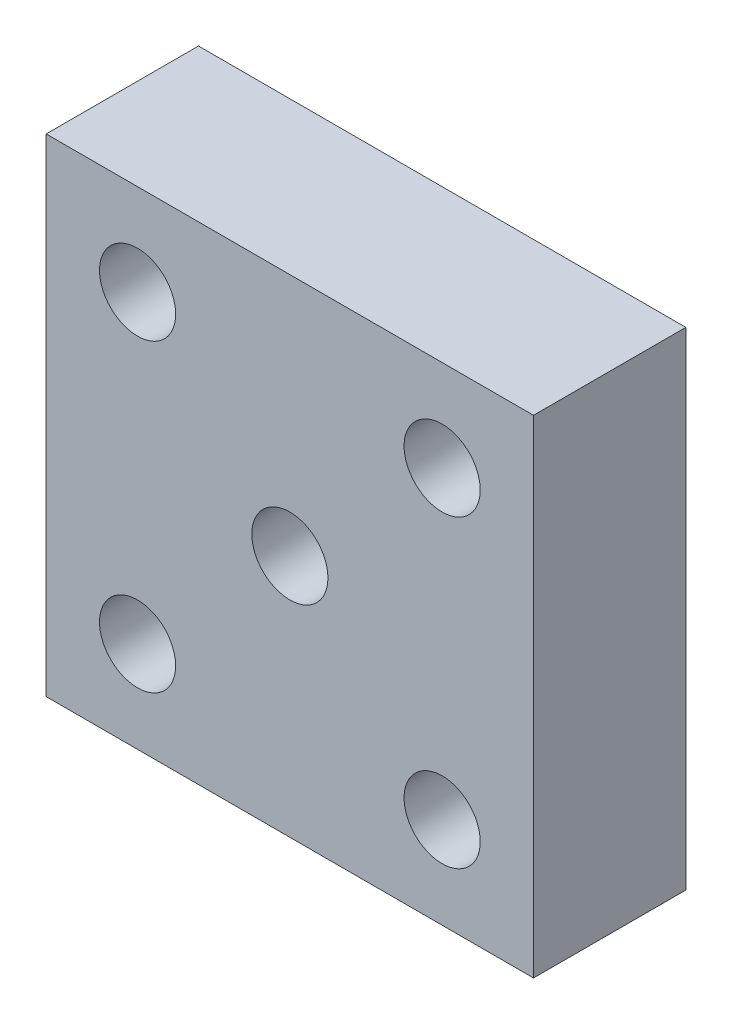
ISO-10303-21;
HEADER;
FILE_DESCRIPTION(('STEP AP214'),'2;1');
FILE_NAME('part.step','',(''),(''),'','','');
FILE_SCHEMA(('AUTOMOTIVE_DESIGN { 1 0 10303 214 1 1 1 1 }'));
ENDSEC;
DATA;
#1=APPLICATION_CONTEXT('core data for automotive mechanical design processes');
#2=APPLICATION_PROTOCOL_DEFINITION('international standard','automotive_design',2000,#1);
#3=PRODUCT_CONTEXT('',#1,'mechanical');
#4=PRODUCT('Part','Part','',(#3));
#5=PRODUCT_RELATED_PRODUCT_CATEGORY('part','',(#4));
#6=PRODUCT_DEFINITION_FORMATION('','',#4);
#7=PRODUCT_DEFINITION_CONTEXT('part definition',#1,'design');
#8=PRODUCT_DEFINITION('design','',#6,#7);
#9=PRODUCT_DEFINITION_SHAPE('','',#8);
#10=(LENGTH_UNIT() NAMED_UNIT(*) SI_UNIT(.MILLI.,.METRE.));
#11=(NAMED_UNIT(*) PLANE_ANGLE_UNIT() SI_UNIT($,.RADIAN.));
#12=(NAMED_UNIT(*) SI_UNIT($,.STERADIAN.) SOLID_ANGLE_UNIT());
#13=UNCERTAINTY_MEASURE_WITH_UNIT(LENGTH_MEASURE(1.E-05),#10,'distance_accuracy_value','');
#14=(GEOMETRIC_REPRESENTATION_CONTEXT(3) GLOBAL_UNCERTAINTY_ASSIGNED_CONTEXT((#13)) GLOBAL_UNIT_ASSIGNED_CONTEXT((#10,
#11,#12)) REPRESENTATION_CONTEXT('',''));
#15=CARTESIAN_POINT('',(0.,0.,0.));
#16=DIRECTION('',(0.,0.,1.));
#17=DIRECTION('',(1.,0.,0.));
#18=AXIS2_PLACEMENT_3D('',#15,#16,#17);
#19=CARTESIAN_POINT('',(0.,0.,5.));
#20=DIRECTION('',(0.,0.,1.));
#21=DIRECTION('',(1.,0.,0.));
#22=AXIS2_PLACEMENT_3D('',#19,#20,#21);
#23=PLANE('',#22);
#24=CARTESIAN_POINT('',(-5.,-5.,5.));
#25=DIRECTION('',(0.,0.,1.));
#26=DIRECTION('',(1.,0.,0.));
#27=AXIS2_PLACEMENT_3D('',#24,#25,#26);
#28=CIRCLE('',#27,1.25);
#29=CARTESIAN_POINT('',(-3.75,-5.,5.));
#30=VERTEX_POINT('',#29);
#31=EDGE_CURVE('E127',#30,#30,#28,.T.);
#32=ORIENTED_EDGE('',*,*,#31,.F.);
#33=EDGE_LOOP('',(#32));
#34=FACE_BOUND('',#33,.T.);
#35=CARTESIAN_POINT('',(5.,5.,5.));
#36=DIRECTION('',(0.,0.,1.));
#37=DIRECTION('',(1.,0.,0.));
#38=AXIS2_PLACEMENT_3D('',#35,#36,#37);
#39=CIRCLE('',#38,1.25);
#40=CARTESIAN_POINT('',(6.25,5.,5.));
#41=VERTEX_POINT('',#40);
#42=EDGE_CURVE('E115',#41,#41,#39,.T.);
#43=ORIENTED_EDGE('',*,*,#42,.F.);
#44=EDGE_LOOP('',(#43));
#45=FACE_BOUND('',#44,.T.);
#46=DIRECTION('',(0.,-1.,0.));
#47=VECTOR('',#46,1.);
#48=CARTESIAN_POINT('',(-7.99999999999999,8.,5.));
#49=LINE('',#48,#47);
#50=CARTESIAN_POINT('',(-7.99999999999999,8.,5.));
#51=VERTEX_POINT('',#50);
#52=CARTESIAN_POINT('',(-7.99999999999999,-8.,5.));
#53=VERTEX_POINT('',#52);
#54=EDGE_CURVE('E85',#51,#53,#49,.T.);
#55=ORIENTED_EDGE('',*,*,#54,.T.);
#56=DIRECTION('',(1.,0.,0.));
#57=VECTOR('',#56,1.);
#58=CARTESIAN_POINT('',(-7.99999999999999,-8.,5.));
#59=LINE('',#58,#57);
#60=CARTESIAN_POINT('',(7.99999999999999,-8.,5.));
#61=VERTEX_POINT('',#60);
#62=EDGE_CURVE('E80',#53,#61,#59,.T.);
#63=ORIENTED_EDGE('',*,*,#62,.T.);
#64=DIRECTION('',(0.,1.,0.));
#65=VECTOR('',#64,1.);
#66=CARTESIAN_POINT('',(7.99999999999999,8.,5.));
#67=LINE('',#66,#65);
#68=CARTESIAN_POINT('',(7.99999999999999,8.,5.));
#69=VERTEX_POINT('',#68);
#70=EDGE_CURVE('E83',#61,#69,#67,.T.);
#71=ORIENTED_EDGE('',*,*,#70,.T.);
#72=DIRECTION('',(-1.,0.,0.));
#73=VECTOR('',#72,1.);
#74=CARTESIAN_POINT('',(-7.99999999999999,8.,5.));
#75=LINE('',#74,#73);
#76=EDGE_CURVE('E50',#69,#51,#75,.T.);
#77=ORIENTED_EDGE('',*,*,#76,.T.);
#78=EDGE_LOOP('',(#55,#63,#71,#77));
#79=FACE_BOUND('',#78,.T.);
#80=CARTESIAN_POINT('',(-5.,5.,5.));
#81=DIRECTION('',(0.,0.,1.));
#82=DIRECTION('',(1.,0.,0.));
#83=AXIS2_PLACEMENT_3D('',#80,#81,#82);
#84=CIRCLE('',#83,1.25);
#85=CARTESIAN_POINT('',(-3.75,5.,5.));
#86=VERTEX_POINT('',#85);
#87=EDGE_CURVE('E100',#86,#86,#84,.T.);
#88=ORIENTED_EDGE('',*,*,#87,.F.);
#89=EDGE_LOOP('',(#88));
#90=FACE_BOUND('',#89,.T.);
#91=CARTESIAN_POINT('',(5.,-5.,5.));
#92=DIRECTION('',(0.,0.,1.));
#93=DIRECTION('',(1.,0.,0.));
#94=AXIS2_PLACEMENT_3D('',#91,#92,#93);
#95=CIRCLE('',#94,1.25);
#96=CARTESIAN_POINT('',(6.25,-5.,5.));
#97=VERTEX_POINT('',#96);
#98=EDGE_CURVE('E121',#97,#97,#95,.T.);
#99=ORIENTED_EDGE('',*,*,#98,.F.);
#100=EDGE_LOOP('',(#99));
#101=FACE_BOUND('',#100,.T.);
#102=CARTESIAN_POINT('',(0.,0.,5.));
#103=DIRECTION('',(0.,0.,1.));
#104=DIRECTION('',(1.,0.,0.));
#105=AXIS2_PLACEMENT_3D('',#102,#103,#104);
#106=CIRCLE('',#105,1.25);
#107=CARTESIAN_POINT('',(1.25,0.,5.));
#108=VERTEX_POINT('',#107);
#109=EDGE_CURVE('E133',#108,#108,#106,.T.);
#110=ORIENTED_EDGE('',*,*,#109,.F.);
#111=EDGE_LOOP('',(#110));
#112=FACE_BOUND('',#111,.T.);
#113=ADVANCED_FACE('F33',(#34,#45,#79,#90,#101,#112),#23,.T.);
#114=CARTESIAN_POINT('',(0.,0.,0.));
#115=DIRECTION('',(0.,0.,1.));
#116=DIRECTION('',(1.,0.,0.));
#117=AXIS2_PLACEMENT_3D('',#114,#115,#116);
#118=PLANE('',#117);
#119=DIRECTION('',(0.,-1.,0.));
#120=VECTOR('',#119,1.);
#121=CARTESIAN_POINT('',(-7.99999999999999,8.,0.));
#122=LINE('',#121,#120);
#123=CARTESIAN_POINT('',(-7.99999999999999,8.,0.));
#124=VERTEX_POINT('',#123);
#125=CARTESIAN_POINT('',(-7.99999999999999,-8.,0.));
#126=VERTEX_POINT('',#125);
#127=EDGE_CURVE('E97',#124,#126,#122,.T.);
#128=ORIENTED_EDGE('',*,*,#127,.F.);
#129=DIRECTION('',(-1.,0.,0.));
#130=VECTOR('',#129,1.);
#131=CARTESIAN_POINT('',(-7.99999999999999,8.,0.));
#132=LINE('',#131,#130);
#133=CARTESIAN_POINT('',(7.99999999999999,8.,0.));
#134=VERTEX_POINT('',#133);
#135=EDGE_CURVE('E73',#134,#124,#132,.T.);
#136=ORIENTED_EDGE('',*,*,#135,.F.);
#137=DIRECTION('',(0.,1.,0.));
#138=VECTOR('',#137,1.);
#139=CARTESIAN_POINT('',(7.99999999999999,8.,0.));
#140=LINE('',#139,#138);
#141=CARTESIAN_POINT('',(7.99999999999999,-8.,0.));
#142=VERTEX_POINT('',#141);
#143=EDGE_CURVE('E67',#142,#134,#140,.T.);
#144=ORIENTED_EDGE('',*,*,#143,.F.);
#145=DIRECTION('',(1.,0.,0.));
#146=VECTOR('',#145,1.);
#147=CARTESIAN_POINT('',(-7.99999999999999,-8.,0.));
#148=LINE('',#147,#146);
#149=EDGE_CURVE('E89',#126,#142,#148,.T.);
#150=ORIENTED_EDGE('',*,*,#149,.F.);
#151=EDGE_LOOP('',(#128,#136,#144,#150));
#152=FACE_BOUND('',#151,.T.);
#153=CARTESIAN_POINT('',(-5.,5.,0.));
#154=DIRECTION('',(0.,0.,1.));
#155=DIRECTION('',(1.,0.,0.));
#156=AXIS2_PLACEMENT_3D('',#153,#154,#155);
#157=CIRCLE('',#156,1.25);
#158=CARTESIAN_POINT('',(-3.75,5.,0.));
#159=VERTEX_POINT('',#158);
#160=EDGE_CURVE('E112',#159,#159,#157,.T.);
#161=ORIENTED_EDGE('',*,*,#160,.T.);
#162=EDGE_LOOP('',(#161));
#163=FACE_BOUND('',#162,.T.);
#164=CARTESIAN_POINT('',(5.,5.,0.));
#165=DIRECTION('',(0.,0.,1.));
#166=DIRECTION('',(1.,0.,0.));
#167=AXIS2_PLACEMENT_3D('',#164,#165,#166);
#168=CIRCLE('',#167,1.25);
#169=CARTESIAN_POINT('',(6.25,5.,0.));
#170=VERTEX_POINT('',#169);
#171=EDGE_CURVE('E118',#170,#170,#168,.T.);
#172=ORIENTED_EDGE('',*,*,#171,.T.);
#173=EDGE_LOOP('',(#172));
#174=FACE_BOUND('',#173,.T.);
#175=CARTESIAN_POINT('',(5.,-5.,0.));
#176=DIRECTION('',(0.,0.,1.));
#177=DIRECTION('',(1.,0.,0.));
#178=AXIS2_PLACEMENT_3D('',#175,#176,#177);
#179=CIRCLE('',#178,1.25);
#180=CARTESIAN_POINT('',(6.25,-5.,0.));
#181=VERTEX_POINT('',#180);
#182=EDGE_CURVE('E124',#181,#181,#179,.T.);
#183=ORIENTED_EDGE('',*,*,#182,.T.);
#184=EDGE_LOOP('',(#183));
#185=FACE_BOUND('',#184,.T.);
#186=CARTESIAN_POINT('',(-5.,-5.,0.));
#187=DIRECTION('',(0.,0.,1.));
#188=DIRECTION('',(1.,0.,0.));
#189=AXIS2_PLACEMENT_3D('',#186,#187,#188);
#190=CIRCLE('',#189,1.25);
#191=CARTESIAN_POINT('',(-3.75,-5.,0.));
#192=VERTEX_POINT('',#191);
#193=EDGE_CURVE('E130',#192,#192,#190,.T.);
#194=ORIENTED_EDGE('',*,*,#193,.T.);
#195=EDGE_LOOP('',(#194));
#196=FACE_BOUND('',#195,.T.);
#197=CARTESIAN_POINT('',(0.,0.,0.));
#198=DIRECTION('',(0.,0.,1.));
#199=DIRECTION('',(1.,0.,0.));
#200=AXIS2_PLACEMENT_3D('',#197,#198,#199);
#201=CIRCLE('',#200,1.25);
#202=CARTESIAN_POINT('',(1.25,0.,0.));
#203=VERTEX_POINT('',#202);
#204=EDGE_CURVE('E136',#203,#203,#201,.T.);
#205=ORIENTED_EDGE('',*,*,#204,.T.);
#206=EDGE_LOOP('',(#205));
#207=FACE_BOUND('',#206,.T.);
#208=ADVANCED_FACE('F108',(#152,#163,#174,#185,#196,#207),#118,.F.);
#209=CARTESIAN_POINT('',(-7.99999999999999,8.,5.));
#210=DIRECTION('',(1.,0.,0.));
#211=DIRECTION('',(0.,0.,-1.));
#212=AXIS2_PLACEMENT_3D('',#209,#210,#211);
#213=PLANE('',#212);
#214=ORIENTED_EDGE('',*,*,#127,.T.);
#215=DIRECTION('',(0.,0.,-1.));
#216=VECTOR('',#215,1.);
#217=CARTESIAN_POINT('',(-7.99999999999999,-8.,5.));
#218=LINE('',#217,#216);
#219=EDGE_CURVE('E11',#53,#126,#218,.T.);
#220=ORIENTED_EDGE('',*,*,#219,.F.);
#221=ORIENTED_EDGE('',*,*,#54,.F.);
#222=DIRECTION('',(0.,0.,-1.));
#223=VECTOR('',#222,1.);
#224=CARTESIAN_POINT('',(-7.99999999999999,8.,5.));
#225=LINE('',#224,#223);
#226=EDGE_CURVE('E93',#51,#124,#225,.T.);
#227=ORIENTED_EDGE('',*,*,#226,.T.);
#228=EDGE_LOOP('',(#214,#220,#221,#227));
#229=FACE_BOUND('',#228,.T.);
#230=ADVANCED_FACE('F35',(#229),#213,.F.);
#231=CARTESIAN_POINT('',(-7.99999999999999,-8.,5.));
#232=DIRECTION('',(0.,1.,0.));
#233=DIRECTION('',(0.,0.,1.));
#234=AXIS2_PLACEMENT_3D('',#231,#232,#233);
#235=PLANE('',#234);
#236=ORIENTED_EDGE('',*,*,#149,.T.);
#237=DIRECTION('',(0.,0.,-1.));
#238=VECTOR('',#237,1.);
#239=CARTESIAN_POINT('',(7.99999999999999,-8.,5.));
#240=LINE('',#239,#238);
#241=EDGE_CURVE('E42',#61,#142,#240,.T.);
#242=ORIENTED_EDGE('',*,*,#241,.F.);
#243=ORIENTED_EDGE('',*,*,#62,.F.);
#244=ORIENTED_EDGE('',*,*,#219,.T.);
#245=EDGE_LOOP('',(#236,#242,#243,#244));
#246=FACE_BOUND('',#245,.T.);
#247=ADVANCED_FACE('F88',(#246),#235,.F.);
#248=CARTESIAN_POINT('',(7.99999999999999,8.,5.));
#249=DIRECTION('',(-1.,0.,0.));
#250=DIRECTION('',(0.,0.,1.));
#251=AXIS2_PLACEMENT_3D('',#248,#249,#250);
#252=PLANE('',#251);
#253=ORIENTED_EDGE('',*,*,#143,.T.);
#254=DIRECTION('',(0.,0.,-1.));
#255=VECTOR('',#254,1.);
#256=CARTESIAN_POINT('',(7.99999999999999,8.,5.));
#257=LINE('',#256,#255);
#258=EDGE_CURVE('E90',#69,#134,#257,.T.);
#259=ORIENTED_EDGE('',*,*,#258,.F.);
#260=ORIENTED_EDGE('',*,*,#70,.F.);
#261=ORIENTED_EDGE('',*,*,#241,.T.);
#262=EDGE_LOOP('',(#253,#259,#260,#261));
#263=FACE_BOUND('',#262,.T.);
#264=ADVANCED_FACE('F91',(#263),#252,.F.);
#265=CARTESIAN_POINT('',(-7.99999999999999,8.,5.));
#266=DIRECTION('',(0.,-1.,0.));
#267=DIRECTION('',(0.,0.,-1.));
#268=AXIS2_PLACEMENT_3D('',#265,#266,#267);
#269=PLANE('',#268);
#270=ORIENTED_EDGE('',*,*,#135,.T.);
#271=ORIENTED_EDGE('',*,*,#226,.F.);
#272=ORIENTED_EDGE('',*,*,#76,.F.);
#273=ORIENTED_EDGE('',*,*,#258,.T.);
#274=EDGE_LOOP('',(#270,#271,#272,#273));
#275=FACE_BOUND('',#274,.T.);
#276=ADVANCED_FACE('F105',(#275),#269,.F.);
#277=CARTESIAN_POINT('',(-5.,5.,5.));
#278=DIRECTION('',(0.,0.,-1.));
#279=DIRECTION('',(-1.,0.,0.));
#280=AXIS2_PLACEMENT_3D('',#277,#278,#279);
#281=CYLINDRICAL_SURFACE('',#280,1.25);
#282=ORIENTED_EDGE('',*,*,#87,.T.);
#283=EDGE_LOOP('',(#282));
#284=FACE_BOUND('',#283,.T.);
#285=ORIENTED_EDGE('',*,*,#160,.F.);
#286=EDGE_LOOP('',(#285));
#287=FACE_BOUND('',#286,.T.);
#288=ADVANCED_FACE('F155',(#284,#287),#281,.F.);
#289=CARTESIAN_POINT('',(5.,5.,5.));
#290=DIRECTION('',(0.,0.,-1.));
#291=DIRECTION('',(-1.,0.,0.));
#292=AXIS2_PLACEMENT_3D('',#289,#290,#291);
#293=CYLINDRICAL_SURFACE('',#292,1.25);
#294=ORIENTED_EDGE('',*,*,#42,.T.);
#295=EDGE_LOOP('',(#294));
#296=FACE_BOUND('',#295,.T.);
#297=ORIENTED_EDGE('',*,*,#171,.F.);
#298=EDGE_LOOP('',(#297));
#299=FACE_BOUND('',#298,.T.);
#300=ADVANCED_FACE('F201',(#296,#299),#293,.F.);
#301=CARTESIAN_POINT('',(5.,-5.,5.));
#302=DIRECTION('',(0.,0.,-1.));
#303=DIRECTION('',(-1.,0.,0.));
#304=AXIS2_PLACEMENT_3D('',#301,#302,#303);
#305=CYLINDRICAL_SURFACE('',#304,1.25);
#306=ORIENTED_EDGE('',*,*,#98,.T.);
#307=EDGE_LOOP('',(#306));
#308=FACE_BOUND('',#307,.T.);
#309=ORIENTED_EDGE('',*,*,#182,.F.);
#310=EDGE_LOOP('',(#309));
#311=FACE_BOUND('',#310,.T.);
#312=ADVANCED_FACE('F209',(#308,#311),#305,.F.);
#313=CARTESIAN_POINT('',(-5.,-5.,5.));
#314=DIRECTION('',(0.,0.,-1.));
#315=DIRECTION('',(-1.,0.,0.));
#316=AXIS2_PLACEMENT_3D('',#313,#314,#315);
#317=CYLINDRICAL_SURFACE('',#316,1.25);
#318=ORIENTED_EDGE('',*,*,#31,.T.);
#319=EDGE_LOOP('',(#318));
#320=FACE_BOUND('',#319,.T.);
#321=ORIENTED_EDGE('',*,*,#193,.F.);
#322=EDGE_LOOP('',(#321));
#323=FACE_BOUND('',#322,.T.);
#324=ADVANCED_FACE('F217',(#320,#323),#317,.F.);
#325=CARTESIAN_POINT('',(0.,0.,5.));
#326=DIRECTION('',(0.,0.,-1.));
#327=DIRECTION('',(-1.,0.,0.));
#328=AXIS2_PLACEMENT_3D('',#325,#326,#327);
#329=CYLINDRICAL_SURFACE('',#328,1.25);
#330=ORIENTED_EDGE('',*,*,#109,.T.);
#331=EDGE_LOOP('',(#330));
#332=FACE_BOUND('',#331,.T.);
#333=ORIENTED_EDGE('',*,*,#204,.F.);
#334=EDGE_LOOP('',(#333));
#335=FACE_BOUND('',#334,.T.);
#336=ADVANCED_FACE('F142',(#332,#335),#329,.F.);
#337=CLOSED_SHELL('',(#113,#208,#230,#247,#264,#276,#288,#300,#312,#324,#336));
#338=MANIFOLD_SOLID_BREP('B2',#337);
#339=ADVANCED_BREP_SHAPE_REPRESENTATION('',(#18,#338),#14);
#340=SHAPE_DEFINITION_REPRESENTATION(#9,#339);
ENDSEC;
END-ISO-10303-21;
